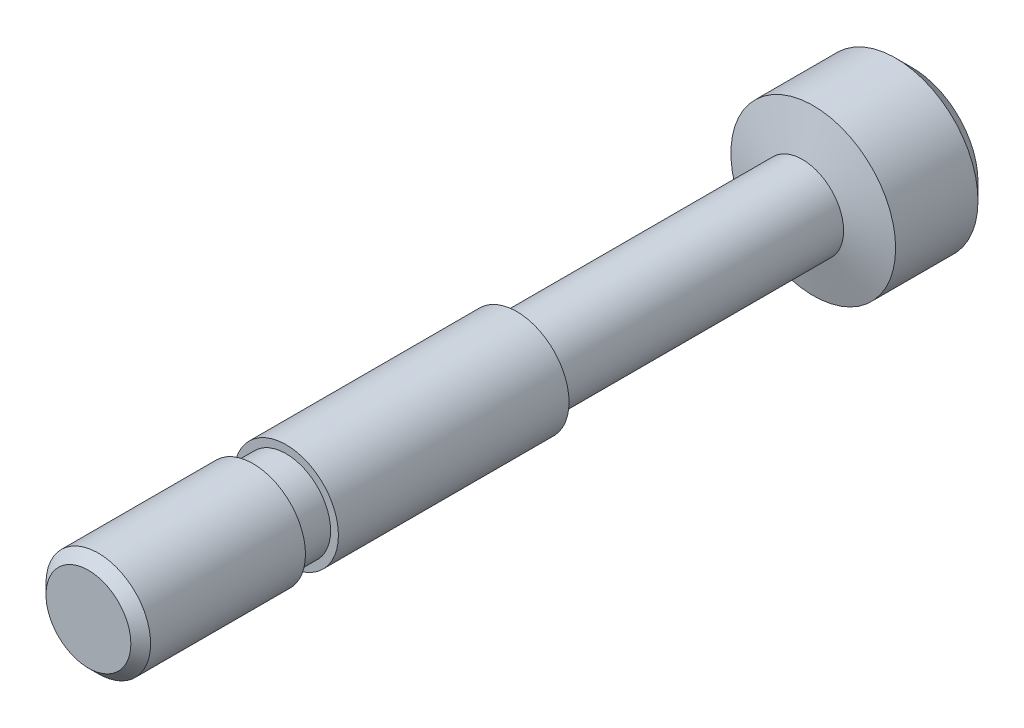
ISO-10303-21;
HEADER;
FILE_DESCRIPTION(('STEP AP214'),'2;1');
FILE_NAME('part.step','',(''),(''),'','','');
FILE_SCHEMA(('AUTOMOTIVE_DESIGN { 1 0 10303 214 1 1 1 1 }'));
ENDSEC;
DATA;
#1=APPLICATION_CONTEXT('core data for automotive mechanical design processes');
#2=APPLICATION_PROTOCOL_DEFINITION('international standard','automotive_design',2000,#1);
#3=PRODUCT_CONTEXT('',#1,'mechanical');
#4=PRODUCT('Part','Part','',(#3));
#5=PRODUCT_RELATED_PRODUCT_CATEGORY('part','',(#4));
#6=PRODUCT_DEFINITION_FORMATION('','',#4);
#7=PRODUCT_DEFINITION_CONTEXT('part definition',#1,'design');
#8=PRODUCT_DEFINITION('design','',#6,#7);
#9=PRODUCT_DEFINITION_SHAPE('','',#8);
#10=(LENGTH_UNIT() NAMED_UNIT(*) SI_UNIT(.MILLI.,.METRE.));
#11=(NAMED_UNIT(*) PLANE_ANGLE_UNIT() SI_UNIT($,.RADIAN.));
#12=(NAMED_UNIT(*) SI_UNIT($,.STERADIAN.) SOLID_ANGLE_UNIT());
#13=UNCERTAINTY_MEASURE_WITH_UNIT(LENGTH_MEASURE(1.E-05),#10,'distance_accuracy_value','');
#14=(GEOMETRIC_REPRESENTATION_CONTEXT(3) GLOBAL_UNCERTAINTY_ASSIGNED_CONTEXT((#13)) GLOBAL_UNIT_ASSIGNED_CONTEXT((#10,
#11,#12)) REPRESENTATION_CONTEXT('',''));
#15=CARTESIAN_POINT('',(0.,0.,0.));
#16=DIRECTION('',(0.,0.,1.));
#17=DIRECTION('',(1.,0.,0.));
#18=AXIS2_PLACEMENT_3D('',#15,#16,#17);
#19=CARTESIAN_POINT('',(0.,0.,-13.19));
#20=DIRECTION('',(0.,0.,1.));
#21=DIRECTION('',(1.,0.,0.));
#22=AXIS2_PLACEMENT_3D('',#19,#20,#21);
#23=CYLINDRICAL_SURFACE('',#22,1.5875);
#24=CARTESIAN_POINT('',(0.,0.,-13.));
#25=DIRECTION('',(0.,0.,1.));
#26=DIRECTION('',(1.,0.,0.));
#27=AXIS2_PLACEMENT_3D('',#24,#25,#26);
#28=CIRCLE('',#27,1.5875);
#29=CARTESIAN_POINT('',(1.5875,0.,-13.));
#30=VERTEX_POINT('',#29);
#31=EDGE_CURVE('E28',#30,#30,#28,.T.);
#32=ORIENTED_EDGE('',*,*,#31,.T.);
#33=EDGE_LOOP('',(#32));
#34=FACE_BOUND('',#33,.T.);
#35=CARTESIAN_POINT('',(0.,0.,-6.));
#36=DIRECTION('',(0.,0.,1.));
#37=DIRECTION('',(1.,0.,0.));
#38=AXIS2_PLACEMENT_3D('',#35,#36,#37);
#39=CIRCLE('',#38,1.5875);
#40=CARTESIAN_POINT('',(1.5875,0.,-6.));
#41=VERTEX_POINT('',#40);
#42=EDGE_CURVE('E39',#41,#41,#39,.F.);
#43=ORIENTED_EDGE('',*,*,#42,.T.);
#44=EDGE_LOOP('',(#43));
#45=FACE_BOUND('',#44,.T.);
#46=ADVANCED_FACE('F13',(#34,#45),#23,.T.);
#47=CARTESIAN_POINT('',(0.,0.,-6.));
#48=DIRECTION('',(0.,0.,1.));
#49=DIRECTION('',(1.,0.,0.));
#50=AXIS2_PLACEMENT_3D('',#47,#48,#49);
#51=PLANE('',#50);
#52=ORIENTED_EDGE('',*,*,#42,.F.);
#53=EDGE_LOOP('',(#52));
#54=FACE_BOUND('',#53,.T.);
#55=CARTESIAN_POINT('',(0.,0.,-6.));
#56=DIRECTION('',(0.,0.,1.));
#57=DIRECTION('',(1.,0.,0.));
#58=AXIS2_PLACEMENT_3D('',#55,#56,#57);
#59=CIRCLE('',#58,1.35);
#60=CARTESIAN_POINT('',(1.35,0.,-6.));
#61=VERTEX_POINT('',#60);
#62=EDGE_CURVE('E45',#61,#61,#59,.T.);
#63=ORIENTED_EDGE('',*,*,#62,.F.);
#64=EDGE_LOOP('',(#63));
#65=FACE_BOUND('',#64,.T.);
#66=ADVANCED_FACE('F76',(#54,#65),#51,.T.);
#67=CARTESIAN_POINT('',(0.,0.,-5.));
#68=DIRECTION('',(0.,0.,1.));
#69=DIRECTION('',(1.,0.,0.));
#70=AXIS2_PLACEMENT_3D('',#67,#68,#69);
#71=PLANE('',#70);
#72=CARTESIAN_POINT('',(0.,0.,-5.));
#73=DIRECTION('',(0.,0.,1.));
#74=DIRECTION('',(1.,0.,0.));
#75=AXIS2_PLACEMENT_3D('',#72,#73,#74);
#76=CIRCLE('',#75,1.5875);
#77=CARTESIAN_POINT('',(1.5875,0.,-5.));
#78=VERTEX_POINT('',#77);
#79=EDGE_CURVE('E42',#78,#78,#76,.F.);
#80=ORIENTED_EDGE('',*,*,#79,.T.);
#81=EDGE_LOOP('',(#80));
#82=FACE_BOUND('',#81,.T.);
#83=CARTESIAN_POINT('',(0.,0.,-5.));
#84=DIRECTION('',(0.,0.,1.));
#85=DIRECTION('',(1.,0.,0.));
#86=AXIS2_PLACEMENT_3D('',#83,#84,#85);
#87=CIRCLE('',#86,1.35);
#88=CARTESIAN_POINT('',(1.35,0.,-5.));
#89=VERTEX_POINT('',#88);
#90=EDGE_CURVE('E46',#89,#89,#87,.T.);
#91=ORIENTED_EDGE('',*,*,#90,.T.);
#92=EDGE_LOOP('',(#91));
#93=FACE_BOUND('',#92,.T.);
#94=ADVANCED_FACE('F83',(#82,#93),#71,.F.);
#95=CARTESIAN_POINT('',(0.,0.,-6.));
#96=DIRECTION('',(0.,0.,1.));
#97=DIRECTION('',(1.,0.,0.));
#98=AXIS2_PLACEMENT_3D('',#95,#96,#97);
#99=CYLINDRICAL_SURFACE('',#98,1.35);
#100=ORIENTED_EDGE('',*,*,#62,.T.);
#101=EDGE_LOOP('',(#100));
#102=FACE_BOUND('',#101,.T.);
#103=ORIENTED_EDGE('',*,*,#90,.F.);
#104=EDGE_LOOP('',(#103));
#105=FACE_BOUND('',#104,.T.);
#106=ADVANCED_FACE('F98',(#102,#105),#99,.T.);
#107=CARTESIAN_POINT('',(0.,0.,0.));
#108=DIRECTION('',(0.,0.,1.));
#109=DIRECTION('',(1.,0.,0.));
#110=AXIS2_PLACEMENT_3D('',#107,#108,#109);
#111=PLANE('',#110);
#112=CARTESIAN_POINT('',(0.,0.,0.));
#113=DIRECTION('',(0.,0.,1.));
#114=DIRECTION('',(1.,0.,0.));
#115=AXIS2_PLACEMENT_3D('',#112,#113,#114);
#116=CIRCLE('',#115,1.28749999999999);
#117=CARTESIAN_POINT('',(1.28749999999999,0.,0.));
#118=VERTEX_POINT('',#117);
#119=EDGE_CURVE('E36',#118,#118,#116,.T.);
#120=ORIENTED_EDGE('',*,*,#119,.T.);
#121=EDGE_LOOP('',(#120));
#122=FACE_BOUND('',#121,.T.);
#123=ADVANCED_FACE('F90',(#122),#111,.T.);
#124=CARTESIAN_POINT('',(0.,0.,-0.300000000000005));
#125=DIRECTION('',(0.,0.,1.));
#126=DIRECTION('',(1.,0.,0.));
#127=AXIS2_PLACEMENT_3D('',#124,#125,#126);
#128=CIRCLE('',#127,1.5875);
#129=CARTESIAN_POINT('',(1.5875,0.,-0.300000000000005));
#130=VERTEX_POINT('',#129);
#131=EDGE_CURVE('E33',#130,#130,#128,.F.);
#132=ORIENTED_EDGE('',*,*,#131,.T.);
#133=EDGE_LOOP('',(#132));
#134=FACE_BOUND('',#133,.T.);
#135=ORIENTED_EDGE('',*,*,#79,.F.);
#136=EDGE_LOOP('',(#135));
#137=FACE_BOUND('',#136,.T.);
#138=ADVANCED_FACE('F79',(#134,#137),#23,.T.);
#139=CARTESIAN_POINT('',(0.,0.,-21.67));
#140=DIRECTION('',(0.,0.,1.));
#141=DIRECTION('',(1.,0.,0.));
#142=AXIS2_PLACEMENT_3D('',#139,#140,#141);
#143=CYLINDRICAL_SURFACE('',#142,1.25);
#144=CARTESIAN_POINT('',(0.,0.,-21.67));
#145=DIRECTION('',(0.,0.,1.));
#146=DIRECTION('',(1.,0.,0.));
#147=AXIS2_PLACEMENT_3D('',#144,#145,#146);
#148=CIRCLE('',#147,1.25);
#149=CARTESIAN_POINT('',(1.25,0.,-21.67));
#150=VERTEX_POINT('',#149);
#151=EDGE_CURVE('E49',#150,#150,#148,.T.);
#152=ORIENTED_EDGE('',*,*,#151,.T.);
#153=EDGE_LOOP('',(#152));
#154=FACE_BOUND('',#153,.T.);
#155=CARTESIAN_POINT('',(0.,0.,-13.19));
#156=DIRECTION('',(0.,0.,1.));
#157=DIRECTION('',(1.,0.,0.));
#158=AXIS2_PLACEMENT_3D('',#155,#156,#157);
#159=CIRCLE('',#158,1.25);
#160=CARTESIAN_POINT('',(1.25,0.,-13.19));
#161=VERTEX_POINT('',#160);
#162=EDGE_CURVE('E52',#161,#161,#159,.T.);
#163=ORIENTED_EDGE('',*,*,#162,.F.);
#164=EDGE_LOOP('',(#163));
#165=FACE_BOUND('',#164,.T.);
#166=ADVANCED_FACE('F58',(#154,#165),#143,.T.);
#167=CARTESIAN_POINT('',(0.,0.,-25.));
#168=DIRECTION('',(0.,0.,1.));
#169=DIRECTION('',(1.,0.,0.));
#170=AXIS2_PLACEMENT_3D('',#167,#168,#169);
#171=PLANE('',#170);
#172=CARTESIAN_POINT('',(0.,0.,-25.));
#173=DIRECTION('',(0.,0.,1.));
#174=DIRECTION('',(1.,0.,0.));
#175=AXIS2_PLACEMENT_3D('',#172,#173,#174);
#176=CIRCLE('',#175,1.99999999999999);
#177=CARTESIAN_POINT('',(1.99999999999999,0.,-25.));
#178=VERTEX_POINT('',#177);
#179=EDGE_CURVE('E9',#178,#178,#176,.F.);
#180=ORIENTED_EDGE('',*,*,#179,.T.);
#181=EDGE_LOOP('',(#180));
#182=FACE_BOUND('',#181,.T.);
#183=ADVANCED_FACE('F96',(#182),#171,.F.);
#184=CARTESIAN_POINT('',(0.,0.,-25.));
#185=DIRECTION('',(0.,0.,1.));
#186=DIRECTION('',(1.,0.,0.));
#187=AXIS2_PLACEMENT_3D('',#184,#185,#186);
#188=CYLINDRICAL_SURFACE('',#187,2.5);
#189=CARTESIAN_POINT('',(0.,0.,-24.5));
#190=DIRECTION('',(0.,0.,1.));
#191=DIRECTION('',(1.,0.,0.));
#192=AXIS2_PLACEMENT_3D('',#189,#190,#191);
#193=CIRCLE('',#192,2.5);
#194=CARTESIAN_POINT('',(2.5,0.,-24.5));
#195=VERTEX_POINT('',#194);
#196=EDGE_CURVE('E20',#195,#195,#193,.T.);
#197=ORIENTED_EDGE('',*,*,#196,.T.);
#198=EDGE_LOOP('',(#197));
#199=FACE_BOUND('',#198,.T.);
#200=CARTESIAN_POINT('',(0.,0.,-22.));
#201=DIRECTION('',(0.,0.,1.));
#202=DIRECTION('',(1.,0.,0.));
#203=AXIS2_PLACEMENT_3D('',#200,#201,#202);
#204=CIRCLE('',#203,2.5);
#205=CARTESIAN_POINT('',(2.5,0.,-22.));
#206=VERTEX_POINT('',#205);
#207=EDGE_CURVE('E24',#206,#206,#204,.F.);
#208=ORIENTED_EDGE('',*,*,#207,.T.);
#209=EDGE_LOOP('',(#208));
#210=FACE_BOUND('',#209,.T.);
#211=ADVANCED_FACE('F150',(#199,#210),#188,.T.);
#212=CARTESIAN_POINT('',(0.,0.,0.));
#213=DIRECTION('',(0.,0.,-1.));
#214=DIRECTION('',(-1.,0.,0.));
#215=AXIS2_PLACEMENT_3D('',#212,#213,#214);
#216=CONICAL_SURFACE('',#215,1.28749999999999,0.78539816339745);
#217=ORIENTED_EDGE('',*,*,#131,.F.);
#218=EDGE_LOOP('',(#217));
#219=FACE_BOUND('',#218,.T.);
#220=ORIENTED_EDGE('',*,*,#119,.F.);
#221=EDGE_LOOP('',(#220));
#222=FACE_BOUND('',#221,.T.);
#223=ADVANCED_FACE('F71',(#219,#222),#216,.T.);
#224=CARTESIAN_POINT('',(0.,0.,-13.19));
#225=DIRECTION('',(0.,0.,1.));
#226=DIRECTION('',(1.,0.,0.));
#227=AXIS2_PLACEMENT_3D('',#224,#225,#226);
#228=CONICAL_SURFACE('',#227,1.24999999999999,1.05805524905843);
#229=ORIENTED_EDGE('',*,*,#31,.F.);
#230=EDGE_LOOP('',(#229));
#231=FACE_BOUND('',#230,.T.);
#232=ORIENTED_EDGE('',*,*,#162,.T.);
#233=EDGE_LOOP('',(#232));
#234=FACE_BOUND('',#233,.T.);
#235=ADVANCED_FACE('F63',(#231,#234),#228,.T.);
#236=CARTESIAN_POINT('',(0.,0.,-21.67));
#237=DIRECTION('',(0.,0.,-1.));
#238=DIRECTION('',(-1.,0.,0.));
#239=AXIS2_PLACEMENT_3D('',#236,#237,#238);
#240=CONICAL_SURFACE('',#239,1.24999999999998,1.31268521041174);
#241=ORIENTED_EDGE('',*,*,#207,.F.);
#242=EDGE_LOOP('',(#241));
#243=FACE_BOUND('',#242,.T.);
#244=ORIENTED_EDGE('',*,*,#151,.F.);
#245=EDGE_LOOP('',(#244));
#246=FACE_BOUND('',#245,.T.);
#247=ADVANCED_FACE('F61',(#243,#246),#240,.T.);
#248=CARTESIAN_POINT('',(0.,0.,-24.5));
#249=DIRECTION('',(0.,0.,1.));
#250=DIRECTION('',(1.,0.,0.));
#251=AXIS2_PLACEMENT_3D('',#248,#249,#250);
#252=CONICAL_SURFACE('',#251,2.5,0.785398163397453);
#253=ORIENTED_EDGE('',*,*,#179,.F.);
#254=EDGE_LOOP('',(#253));
#255=FACE_BOUND('',#254,.T.);
#256=ORIENTED_EDGE('',*,*,#196,.F.);
#257=EDGE_LOOP('',(#256));
#258=FACE_BOUND('',#257,.T.);
#259=ADVANCED_FACE('F15',(#255,#258),#252,.T.);
#260=CLOSED_SHELL('',(#46,#66,#94,#106,#123,#138,#166,#183,#211,#223,#235,#247,#259));
#261=MANIFOLD_SOLID_BREP('B1',#260);
#262=ADVANCED_BREP_SHAPE_REPRESENTATION('',(#18,#261),#14);
#263=SHAPE_DEFINITION_REPRESENTATION(#9,#262);
ENDSEC;
END-ISO-10303-21;
